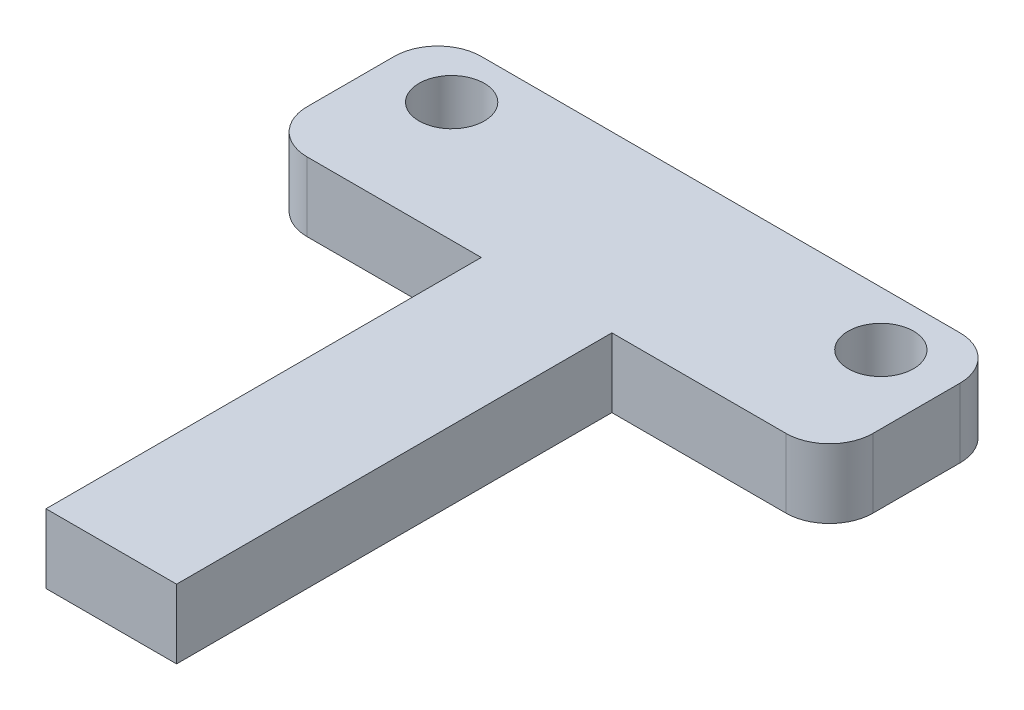
ISO-10303-21;
HEADER;
FILE_DESCRIPTION(('STEP AP214'),'2;1');
FILE_NAME('part.step','',(''),(''),'','','');
FILE_SCHEMA(('AUTOMOTIVE_DESIGN { 1 0 10303 214 1 1 1 1 }'));
ENDSEC;
DATA;
#1=APPLICATION_CONTEXT('core data for automotive mechanical design processes');
#2=APPLICATION_PROTOCOL_DEFINITION('international standard','automotive_design',2000,#1);
#3=PRODUCT_CONTEXT('',#1,'mechanical');
#4=PRODUCT('Part','Part','',(#3));
#5=PRODUCT_RELATED_PRODUCT_CATEGORY('part','',(#4));
#6=PRODUCT_DEFINITION_FORMATION('','',#4);
#7=PRODUCT_DEFINITION_CONTEXT('part definition',#1,'design');
#8=PRODUCT_DEFINITION('design','',#6,#7);
#9=PRODUCT_DEFINITION_SHAPE('','',#8);
#10=(LENGTH_UNIT() NAMED_UNIT(*) SI_UNIT(.MILLI.,.METRE.));
#11=(NAMED_UNIT(*) PLANE_ANGLE_UNIT() SI_UNIT($,.RADIAN.));
#12=(NAMED_UNIT(*) SI_UNIT($,.STERADIAN.) SOLID_ANGLE_UNIT());
#13=UNCERTAINTY_MEASURE_WITH_UNIT(LENGTH_MEASURE(1.E-05),#10,'distance_accuracy_value','');
#14=(GEOMETRIC_REPRESENTATION_CONTEXT(3) GLOBAL_UNCERTAINTY_ASSIGNED_CONTEXT((#13)) GLOBAL_UNIT_ASSIGNED_CONTEXT((#10,
#11,#12)) REPRESENTATION_CONTEXT('',''));
#15=CARTESIAN_POINT('',(0.,0.,0.));
#16=DIRECTION('',(0.,0.,1.));
#17=DIRECTION('',(1.,0.,0.));
#18=AXIS2_PLACEMENT_3D('',#15,#16,#17);
#19=CARTESIAN_POINT('',(11.,3.175,2.));
#20=DIRECTION('',(0.,1.,0.));
#21=DIRECTION('',(0.,0.,1.));
#22=AXIS2_PLACEMENT_3D('',#19,#20,#21);
#23=PLANE('',#22);
#24=CARTESIAN_POINT('',(-9.85999999999999,3.175,-1.5));
#25=DIRECTION('',(0.,1.,0.));
#26=DIRECTION('',(0.,0.,1.));
#27=AXIS2_PLACEMENT_3D('',#24,#25,#26);
#28=CIRCLE('',#27,1.5);
#29=CARTESIAN_POINT('',(-9.85999999999999,3.175,0.));
#30=VERTEX_POINT('',#29);
#31=EDGE_CURVE('E180',#30,#30,#28,.T.);
#32=ORIENTED_EDGE('',*,*,#31,.F.);
#33=EDGE_LOOP('',(#32));
#34=FACE_BOUND('',#33,.T.);
#35=DIRECTION('',(0.,0.,1.));
#36=VECTOR('',#35,1.);
#37=CARTESIAN_POINT('',(-2.99999999999999,3.175,4.));
#38=LINE('',#37,#36);
#39=CARTESIAN_POINT('',(-2.99999999999999,3.175,4.));
#40=VERTEX_POINT('',#39);
#41=CARTESIAN_POINT('',(-2.99999999999999,3.175,24.));
#42=VERTEX_POINT('',#41);
#43=EDGE_CURVE('E210',#40,#42,#38,.T.);
#44=ORIENTED_EDGE('',*,*,#43,.T.);
#45=DIRECTION('',(1.,0.,0.));
#46=VECTOR('',#45,1.);
#47=CARTESIAN_POINT('',(-2.99999999999999,3.175,24.));
#48=LINE('',#47,#46);
#49=CARTESIAN_POINT('',(3.,3.175,24.));
#50=VERTEX_POINT('',#49);
#51=EDGE_CURVE('E120',#42,#50,#48,.T.);
#52=ORIENTED_EDGE('',*,*,#51,.T.);
#53=DIRECTION('',(0.,0.,-1.));
#54=VECTOR('',#53,1.);
#55=CARTESIAN_POINT('',(3.00000000000001,3.175,4.));
#56=LINE('',#55,#54);
#57=CARTESIAN_POINT('',(3.00000000000001,3.175,4.));
#58=VERTEX_POINT('',#57);
#59=EDGE_CURVE('E249',#50,#58,#56,.T.);
#60=ORIENTED_EDGE('',*,*,#59,.T.);
#61=DIRECTION('',(1.,0.,0.));
#62=VECTOR('',#61,1.);
#63=CARTESIAN_POINT('',(3.00000000000001,3.175,4.));
#64=LINE('',#63,#62);
#65=CARTESIAN_POINT('',(11.,3.175,4.));
#66=VERTEX_POINT('',#65);
#67=EDGE_CURVE('E269',#58,#66,#64,.T.);
#68=ORIENTED_EDGE('',*,*,#67,.T.);
#69=CARTESIAN_POINT('',(11.,3.175,2.));
#70=DIRECTION('',(0.,1.,0.));
#71=DIRECTION('',(0.,0.,1.));
#72=AXIS2_PLACEMENT_3D('',#69,#70,#71);
#73=CIRCLE('',#72,2.);
#74=CARTESIAN_POINT('',(13.,3.175,2.));
#75=VERTEX_POINT('',#74);
#76=EDGE_CURVE('E265',#66,#75,#73,.T.);
#77=ORIENTED_EDGE('',*,*,#76,.T.);
#78=DIRECTION('',(0.,0.,-1.));
#79=VECTOR('',#78,1.);
#80=CARTESIAN_POINT('',(13.,3.175,-2.));
#81=LINE('',#80,#79);
#82=CARTESIAN_POINT('',(13.,3.175,-2.));
#83=VERTEX_POINT('',#82);
#84=EDGE_CURVE('E268',#75,#83,#81,.T.);
#85=ORIENTED_EDGE('',*,*,#84,.T.);
#86=CARTESIAN_POINT('',(11.,3.175,-2.));
#87=DIRECTION('',(0.,1.,0.));
#88=DIRECTION('',(0.,0.,-1.));
#89=AXIS2_PLACEMENT_3D('',#86,#87,#88);
#90=CIRCLE('',#89,2.);
#91=CARTESIAN_POINT('',(11.,3.175,-4.));
#92=VERTEX_POINT('',#91);
#93=EDGE_CURVE('E275',#83,#92,#90,.T.);
#94=ORIENTED_EDGE('',*,*,#93,.T.);
#95=DIRECTION('',(-1.,0.,0.));
#96=VECTOR('',#95,1.);
#97=CARTESIAN_POINT('',(-11.,3.175,-4.));
#98=LINE('',#97,#96);
#99=CARTESIAN_POINT('',(-11.,3.175,-4.));
#100=VERTEX_POINT('',#99);
#101=EDGE_CURVE('E282',#92,#100,#98,.T.);
#102=ORIENTED_EDGE('',*,*,#101,.T.);
#103=CARTESIAN_POINT('',(-11.,3.175,-2.));
#104=DIRECTION('',(0.,1.,0.));
#105=DIRECTION('',(0.,0.,1.));
#106=AXIS2_PLACEMENT_3D('',#103,#104,#105);
#107=CIRCLE('',#106,2.);
#108=CARTESIAN_POINT('',(-13.,3.175,-2.));
#109=VERTEX_POINT('',#108);
#110=EDGE_CURVE('E151',#100,#109,#107,.T.);
#111=ORIENTED_EDGE('',*,*,#110,.T.);
#112=DIRECTION('',(0.,0.,1.));
#113=VECTOR('',#112,1.);
#114=CARTESIAN_POINT('',(-13.,3.175,-2.));
#115=LINE('',#114,#113);
#116=CARTESIAN_POINT('',(-13.,3.175,2.));
#117=VERTEX_POINT('',#116);
#118=EDGE_CURVE('E145',#109,#117,#115,.T.);
#119=ORIENTED_EDGE('',*,*,#118,.T.);
#120=CARTESIAN_POINT('',(-11.,3.175,2.));
#121=DIRECTION('',(0.,1.,0.));
#122=DIRECTION('',(0.,0.,1.));
#123=AXIS2_PLACEMENT_3D('',#120,#121,#122);
#124=CIRCLE('',#123,2.);
#125=CARTESIAN_POINT('',(-11.,3.175,4.));
#126=VERTEX_POINT('',#125);
#127=EDGE_CURVE('E149',#117,#126,#124,.T.);
#128=ORIENTED_EDGE('',*,*,#127,.T.);
#129=DIRECTION('',(1.,0.,0.));
#130=VECTOR('',#129,1.);
#131=CARTESIAN_POINT('',(-11.,3.175,4.));
#132=LINE('',#131,#130);
#133=EDGE_CURVE('E65',#126,#40,#132,.T.);
#134=ORIENTED_EDGE('',*,*,#133,.T.);
#135=EDGE_LOOP('',(#44,#52,#60,#68,#77,#85,#94,#102,#111,#119,#128,#134));
#136=FACE_BOUND('',#135,.T.);
#137=CARTESIAN_POINT('',(9.86000000000001,3.175,-1.5));
#138=DIRECTION('',(0.,1.,0.));
#139=DIRECTION('',(0.,0.,-1.));
#140=AXIS2_PLACEMENT_3D('',#137,#138,#139);
#141=CIRCLE('',#140,1.5);
#142=CARTESIAN_POINT('',(9.86000000000001,3.175,-3.));
#143=VERTEX_POINT('',#142);
#144=EDGE_CURVE('E342',#143,#143,#141,.T.);
#145=ORIENTED_EDGE('',*,*,#144,.F.);
#146=EDGE_LOOP('',(#145));
#147=FACE_BOUND('',#146,.T.);
#148=ADVANCED_FACE('F47',(#34,#136,#147),#23,.T.);
#149=CARTESIAN_POINT('',(11.,0.,2.));
#150=DIRECTION('',(0.,1.,0.));
#151=DIRECTION('',(0.,0.,1.));
#152=AXIS2_PLACEMENT_3D('',#149,#150,#151);
#153=PLANE('',#152);
#154=DIRECTION('',(0.,0.,1.));
#155=VECTOR('',#154,1.);
#156=CARTESIAN_POINT('',(-2.99999999999999,0.,4.));
#157=LINE('',#156,#155);
#158=CARTESIAN_POINT('',(-2.99999999999999,0.,4.));
#159=VERTEX_POINT('',#158);
#160=CARTESIAN_POINT('',(-2.99999999999999,0.,24.));
#161=VERTEX_POINT('',#160);
#162=EDGE_CURVE('E175',#159,#161,#157,.T.);
#163=ORIENTED_EDGE('',*,*,#162,.F.);
#164=DIRECTION('',(1.,0.,0.));
#165=VECTOR('',#164,1.);
#166=CARTESIAN_POINT('',(-11.,0.,4.));
#167=LINE('',#166,#165);
#168=CARTESIAN_POINT('',(-11.,0.,4.));
#169=VERTEX_POINT('',#168);
#170=EDGE_CURVE('E112',#169,#159,#167,.T.);
#171=ORIENTED_EDGE('',*,*,#170,.F.);
#172=CARTESIAN_POINT('',(-11.,0.,2.));
#173=DIRECTION('',(0.,1.,0.));
#174=DIRECTION('',(0.,0.,1.));
#175=AXIS2_PLACEMENT_3D('',#172,#173,#174);
#176=CIRCLE('',#175,2.);
#177=CARTESIAN_POINT('',(-13.,0.,2.));
#178=VERTEX_POINT('',#177);
#179=EDGE_CURVE('E106',#178,#169,#176,.T.);
#180=ORIENTED_EDGE('',*,*,#179,.F.);
#181=DIRECTION('',(0.,0.,1.));
#182=VECTOR('',#181,1.);
#183=CARTESIAN_POINT('',(-13.,0.,-2.));
#184=LINE('',#183,#182);
#185=CARTESIAN_POINT('',(-13.,0.,-2.));
#186=VERTEX_POINT('',#185);
#187=EDGE_CURVE('E160',#186,#178,#184,.T.);
#188=ORIENTED_EDGE('',*,*,#187,.F.);
#189=CARTESIAN_POINT('',(-11.,0.,-2.));
#190=DIRECTION('',(0.,1.,0.));
#191=DIRECTION('',(0.,0.,1.));
#192=AXIS2_PLACEMENT_3D('',#189,#190,#191);
#193=CIRCLE('',#192,2.);
#194=CARTESIAN_POINT('',(-11.,0.,-4.));
#195=VERTEX_POINT('',#194);
#196=EDGE_CURVE('E201',#195,#186,#193,.T.);
#197=ORIENTED_EDGE('',*,*,#196,.F.);
#198=DIRECTION('',(-1.,0.,0.));
#199=VECTOR('',#198,1.);
#200=CARTESIAN_POINT('',(-11.,0.,-4.));
#201=LINE('',#200,#199);
#202=CARTESIAN_POINT('',(11.,0.,-4.));
#203=VERTEX_POINT('',#202);
#204=EDGE_CURVE('E198',#203,#195,#201,.T.);
#205=ORIENTED_EDGE('',*,*,#204,.F.);
#206=CARTESIAN_POINT('',(11.,0.,-2.));
#207=DIRECTION('',(0.,1.,0.));
#208=DIRECTION('',(0.,0.,-1.));
#209=AXIS2_PLACEMENT_3D('',#206,#207,#208);
#210=CIRCLE('',#209,2.);
#211=CARTESIAN_POINT('',(13.,0.,-2.));
#212=VERTEX_POINT('',#211);
#213=EDGE_CURVE('E195',#212,#203,#210,.T.);
#214=ORIENTED_EDGE('',*,*,#213,.F.);
#215=DIRECTION('',(0.,0.,-1.));
#216=VECTOR('',#215,1.);
#217=CARTESIAN_POINT('',(13.,0.,-2.));
#218=LINE('',#217,#216);
#219=CARTESIAN_POINT('',(13.,0.,2.));
#220=VERTEX_POINT('',#219);
#221=EDGE_CURVE('E192',#220,#212,#218,.T.);
#222=ORIENTED_EDGE('',*,*,#221,.F.);
#223=CARTESIAN_POINT('',(11.,0.,2.));
#224=DIRECTION('',(0.,1.,0.));
#225=DIRECTION('',(0.,0.,1.));
#226=AXIS2_PLACEMENT_3D('',#223,#224,#225);
#227=CIRCLE('',#226,2.);
#228=CARTESIAN_POINT('',(11.,0.,4.));
#229=VERTEX_POINT('',#228);
#230=EDGE_CURVE('E189',#229,#220,#227,.T.);
#231=ORIENTED_EDGE('',*,*,#230,.F.);
#232=DIRECTION('',(1.,0.,0.));
#233=VECTOR('',#232,1.);
#234=CARTESIAN_POINT('',(3.00000000000001,0.,4.));
#235=LINE('',#234,#233);
#236=CARTESIAN_POINT('',(3.00000000000001,0.,4.));
#237=VERTEX_POINT('',#236);
#238=EDGE_CURVE('E186',#237,#229,#235,.T.);
#239=ORIENTED_EDGE('',*,*,#238,.F.);
#240=DIRECTION('',(0.,0.,-1.));
#241=VECTOR('',#240,1.);
#242=CARTESIAN_POINT('',(3.00000000000001,0.,4.));
#243=LINE('',#242,#241);
#244=CARTESIAN_POINT('',(3.,0.,24.));
#245=VERTEX_POINT('',#244);
#246=EDGE_CURVE('E183',#245,#237,#243,.T.);
#247=ORIENTED_EDGE('',*,*,#246,.F.);
#248=DIRECTION('',(1.,0.,0.));
#249=VECTOR('',#248,1.);
#250=CARTESIAN_POINT('',(-2.99999999999999,0.,24.));
#251=LINE('',#250,#249);
#252=EDGE_CURVE('E179',#161,#245,#251,.T.);
#253=ORIENTED_EDGE('',*,*,#252,.F.);
#254=EDGE_LOOP('',(#163,#171,#180,#188,#197,#205,#214,#222,#231,#239,#247,#253));
#255=FACE_BOUND('',#254,.T.);
#256=CARTESIAN_POINT('',(-9.85999999999999,0.,-1.5));
#257=DIRECTION('',(0.,1.,0.));
#258=DIRECTION('',(0.,0.,1.));
#259=AXIS2_PLACEMENT_3D('',#256,#257,#258);
#260=CIRCLE('',#259,1.5);
#261=CARTESIAN_POINT('',(-9.85999999999999,0.,0.));
#262=VERTEX_POINT('',#261);
#263=EDGE_CURVE('E336',#262,#262,#260,.T.);
#264=ORIENTED_EDGE('',*,*,#263,.T.);
#265=EDGE_LOOP('',(#264));
#266=FACE_BOUND('',#265,.T.);
#267=CARTESIAN_POINT('',(9.86000000000001,0.,-1.5));
#268=DIRECTION('',(0.,1.,0.));
#269=DIRECTION('',(0.,0.,-1.));
#270=AXIS2_PLACEMENT_3D('',#267,#268,#269);
#271=CIRCLE('',#270,1.5);
#272=CARTESIAN_POINT('',(9.86000000000001,0.,-3.));
#273=VERTEX_POINT('',#272);
#274=EDGE_CURVE('E348',#273,#273,#271,.T.);
#275=ORIENTED_EDGE('',*,*,#274,.T.);
#276=EDGE_LOOP('',(#275));
#277=FACE_BOUND('',#276,.T.);
#278=ADVANCED_FACE('F253',(#255,#266,#277),#153,.F.);
#279=CARTESIAN_POINT('',(-2.99999999999999,3.175,4.));
#280=DIRECTION('',(1.,0.,0.));
#281=DIRECTION('',(0.,0.,-1.));
#282=AXIS2_PLACEMENT_3D('',#279,#280,#281);
#283=PLANE('',#282);
#284=ORIENTED_EDGE('',*,*,#162,.T.);
#285=DIRECTION('',(0.,-1.,0.));
#286=VECTOR('',#285,1.);
#287=CARTESIAN_POINT('',(-2.99999999999999,3.175,24.));
#288=LINE('',#287,#286);
#289=EDGE_CURVE('E11',#42,#161,#288,.T.);
#290=ORIENTED_EDGE('',*,*,#289,.F.);
#291=ORIENTED_EDGE('',*,*,#43,.F.);
#292=DIRECTION('',(0.,-1.,0.));
#293=VECTOR('',#292,1.);
#294=CARTESIAN_POINT('',(-2.99999999999999,3.175,4.));
#295=LINE('',#294,#293);
#296=EDGE_CURVE('E171',#40,#159,#295,.T.);
#297=ORIENTED_EDGE('',*,*,#296,.T.);
#298=EDGE_LOOP('',(#284,#290,#291,#297));
#299=FACE_BOUND('',#298,.T.);
#300=ADVANCED_FACE('F49',(#299),#283,.F.);
#301=CARTESIAN_POINT('',(-2.99999999999999,3.175,24.));
#302=DIRECTION('',(0.,0.,-1.));
#303=DIRECTION('',(-1.,0.,0.));
#304=AXIS2_PLACEMENT_3D('',#301,#302,#303);
#305=PLANE('',#304);
#306=ORIENTED_EDGE('',*,*,#252,.T.);
#307=DIRECTION('',(0.,-1.,0.));
#308=VECTOR('',#307,1.);
#309=CARTESIAN_POINT('',(3.,3.175,24.));
#310=LINE('',#309,#308);
#311=EDGE_CURVE('E57',#50,#245,#310,.T.);
#312=ORIENTED_EDGE('',*,*,#311,.F.);
#313=ORIENTED_EDGE('',*,*,#51,.F.);
#314=ORIENTED_EDGE('',*,*,#289,.T.);
#315=EDGE_LOOP('',(#306,#312,#313,#314));
#316=FACE_BOUND('',#315,.T.);
#317=ADVANCED_FACE('F405',(#316),#305,.F.);
#318=CARTESIAN_POINT('',(3.00000000000001,3.175,4.));
#319=DIRECTION('',(-1.,0.,0.));
#320=DIRECTION('',(0.,0.,1.));
#321=AXIS2_PLACEMENT_3D('',#318,#319,#320);
#322=PLANE('',#321);
#323=ORIENTED_EDGE('',*,*,#246,.T.);
#324=DIRECTION('',(0.,-1.,0.));
#325=VECTOR('',#324,1.);
#326=CARTESIAN_POINT('',(3.00000000000001,3.175,4.));
#327=LINE('',#326,#325);
#328=EDGE_CURVE('E237',#58,#237,#327,.T.);
#329=ORIENTED_EDGE('',*,*,#328,.F.);
#330=ORIENTED_EDGE('',*,*,#59,.F.);
#331=ORIENTED_EDGE('',*,*,#311,.T.);
#332=EDGE_LOOP('',(#323,#329,#330,#331));
#333=FACE_BOUND('',#332,.T.);
#334=ADVANCED_FACE('F247',(#333),#322,.F.);
#335=CARTESIAN_POINT('',(3.00000000000001,3.175,4.));
#336=DIRECTION('',(0.,0.,-1.));
#337=DIRECTION('',(-1.,0.,0.));
#338=AXIS2_PLACEMENT_3D('',#335,#336,#337);
#339=PLANE('',#338);
#340=ORIENTED_EDGE('',*,*,#238,.T.);
#341=DIRECTION('',(0.,-1.,0.));
#342=VECTOR('',#341,1.);
#343=CARTESIAN_POINT('',(11.,3.175,4.));
#344=LINE('',#343,#342);
#345=EDGE_CURVE('E233',#66,#229,#344,.T.);
#346=ORIENTED_EDGE('',*,*,#345,.F.);
#347=ORIENTED_EDGE('',*,*,#67,.F.);
#348=ORIENTED_EDGE('',*,*,#328,.T.);
#349=EDGE_LOOP('',(#340,#346,#347,#348));
#350=FACE_BOUND('',#349,.T.);
#351=ADVANCED_FACE('F259',(#350),#339,.F.);
#352=CARTESIAN_POINT('',(11.,3.175,2.));
#353=DIRECTION('',(0.,-1.,0.));
#354=DIRECTION('',(0.,0.,-1.));
#355=AXIS2_PLACEMENT_3D('',#352,#353,#354);
#356=CYLINDRICAL_SURFACE('',#355,2.);
#357=ORIENTED_EDGE('',*,*,#230,.T.);
#358=DIRECTION('',(0.,-1.,0.));
#359=VECTOR('',#358,1.);
#360=CARTESIAN_POINT('',(13.,3.175,2.));
#361=LINE('',#360,#359);
#362=EDGE_CURVE('E229',#75,#220,#361,.T.);
#363=ORIENTED_EDGE('',*,*,#362,.F.);
#364=ORIENTED_EDGE('',*,*,#76,.F.);
#365=ORIENTED_EDGE('',*,*,#345,.T.);
#366=EDGE_LOOP('',(#357,#363,#364,#365));
#367=FACE_BOUND('',#366,.T.);
#368=ADVANCED_FACE('F263',(#367),#356,.T.);
#369=CARTESIAN_POINT('',(13.,3.175,-2.));
#370=DIRECTION('',(-1.,0.,0.));
#371=DIRECTION('',(0.,0.,1.));
#372=AXIS2_PLACEMENT_3D('',#369,#370,#371);
#373=PLANE('',#372);
#374=ORIENTED_EDGE('',*,*,#221,.T.);
#375=DIRECTION('',(0.,-1.,0.));
#376=VECTOR('',#375,1.);
#377=CARTESIAN_POINT('',(13.,3.175,-2.));
#378=LINE('',#377,#376);
#379=EDGE_CURVE('E225',#83,#212,#378,.T.);
#380=ORIENTED_EDGE('',*,*,#379,.F.);
#381=ORIENTED_EDGE('',*,*,#84,.F.);
#382=ORIENTED_EDGE('',*,*,#362,.T.);
#383=EDGE_LOOP('',(#374,#380,#381,#382));
#384=FACE_BOUND('',#383,.T.);
#385=ADVANCED_FACE('F395',(#384),#373,.F.);
#386=CARTESIAN_POINT('',(11.,3.175,-2.));
#387=DIRECTION('',(0.,-1.,0.));
#388=DIRECTION('',(0.,0.,-1.));
#389=AXIS2_PLACEMENT_3D('',#386,#387,#388);
#390=CYLINDRICAL_SURFACE('',#389,2.);
#391=ORIENTED_EDGE('',*,*,#213,.T.);
#392=DIRECTION('',(0.,-1.,0.));
#393=VECTOR('',#392,1.);
#394=CARTESIAN_POINT('',(11.,3.175,-4.));
#395=LINE('',#394,#393);
#396=EDGE_CURVE('E221',#92,#203,#395,.T.);
#397=ORIENTED_EDGE('',*,*,#396,.F.);
#398=ORIENTED_EDGE('',*,*,#93,.F.);
#399=ORIENTED_EDGE('',*,*,#379,.T.);
#400=EDGE_LOOP('',(#391,#397,#398,#399));
#401=FACE_BOUND('',#400,.T.);
#402=ADVANCED_FACE('F391',(#401),#390,.T.);
#403=CARTESIAN_POINT('',(-11.,3.175,-4.));
#404=DIRECTION('',(0.,0.,1.));
#405=DIRECTION('',(1.,0.,0.));
#406=AXIS2_PLACEMENT_3D('',#403,#404,#405);
#407=PLANE('',#406);
#408=ORIENTED_EDGE('',*,*,#204,.T.);
#409=DIRECTION('',(0.,-1.,0.));
#410=VECTOR('',#409,1.);
#411=CARTESIAN_POINT('',(-11.,3.175,-4.));
#412=LINE('',#411,#410);
#413=EDGE_CURVE('E217',#100,#195,#412,.T.);
#414=ORIENTED_EDGE('',*,*,#413,.F.);
#415=ORIENTED_EDGE('',*,*,#101,.F.);
#416=ORIENTED_EDGE('',*,*,#396,.T.);
#417=EDGE_LOOP('',(#408,#414,#415,#416));
#418=FACE_BOUND('',#417,.T.);
#419=ADVANCED_FACE('F387',(#418),#407,.F.);
#420=CARTESIAN_POINT('',(-11.,3.175,-2.));
#421=DIRECTION('',(0.,-1.,0.));
#422=DIRECTION('',(0.,0.,-1.));
#423=AXIS2_PLACEMENT_3D('',#420,#421,#422);
#424=CYLINDRICAL_SURFACE('',#423,2.);
#425=ORIENTED_EDGE('',*,*,#196,.T.);
#426=DIRECTION('',(0.,-1.,0.));
#427=VECTOR('',#426,1.);
#428=CARTESIAN_POINT('',(-13.,3.175,-2.));
#429=LINE('',#428,#427);
#430=EDGE_CURVE('E162',#109,#186,#429,.T.);
#431=ORIENTED_EDGE('',*,*,#430,.F.);
#432=ORIENTED_EDGE('',*,*,#110,.F.);
#433=ORIENTED_EDGE('',*,*,#413,.T.);
#434=EDGE_LOOP('',(#425,#431,#432,#433));
#435=FACE_BOUND('',#434,.T.);
#436=ADVANCED_FACE('F384',(#435),#424,.T.);
#437=CARTESIAN_POINT('',(-13.,3.175,-2.));
#438=DIRECTION('',(1.,0.,0.));
#439=DIRECTION('',(0.,0.,-1.));
#440=AXIS2_PLACEMENT_3D('',#437,#438,#439);
#441=PLANE('',#440);
#442=ORIENTED_EDGE('',*,*,#187,.T.);
#443=DIRECTION('',(0.,-1.,0.));
#444=VECTOR('',#443,1.);
#445=CARTESIAN_POINT('',(-13.,3.175,2.));
#446=LINE('',#445,#444);
#447=EDGE_CURVE('E157',#117,#178,#446,.T.);
#448=ORIENTED_EDGE('',*,*,#447,.F.);
#449=ORIENTED_EDGE('',*,*,#118,.F.);
#450=ORIENTED_EDGE('',*,*,#430,.T.);
#451=EDGE_LOOP('',(#442,#448,#449,#450));
#452=FACE_BOUND('',#451,.T.);
#453=ADVANCED_FACE('F158',(#452),#441,.F.);
#454=CARTESIAN_POINT('',(-11.,3.175,2.));
#455=DIRECTION('',(0.,-1.,0.));
#456=DIRECTION('',(0.,0.,-1.));
#457=AXIS2_PLACEMENT_3D('',#454,#455,#456);
#458=CYLINDRICAL_SURFACE('',#457,2.);
#459=ORIENTED_EDGE('',*,*,#179,.T.);
#460=DIRECTION('',(0.,-1.,0.));
#461=VECTOR('',#460,1.);
#462=CARTESIAN_POINT('',(-11.,3.175,4.));
#463=LINE('',#462,#461);
#464=EDGE_CURVE('E163',#126,#169,#463,.T.);
#465=ORIENTED_EDGE('',*,*,#464,.F.);
#466=ORIENTED_EDGE('',*,*,#127,.F.);
#467=ORIENTED_EDGE('',*,*,#447,.T.);
#468=EDGE_LOOP('',(#459,#465,#466,#467));
#469=FACE_BOUND('',#468,.T.);
#470=ADVANCED_FACE('F165',(#469),#458,.T.);
#471=CARTESIAN_POINT('',(-11.,3.175,4.));
#472=DIRECTION('',(0.,0.,-1.));
#473=DIRECTION('',(-1.,0.,0.));
#474=AXIS2_PLACEMENT_3D('',#471,#472,#473);
#475=PLANE('',#474);
#476=ORIENTED_EDGE('',*,*,#170,.T.);
#477=ORIENTED_EDGE('',*,*,#296,.F.);
#478=ORIENTED_EDGE('',*,*,#133,.F.);
#479=ORIENTED_EDGE('',*,*,#464,.T.);
#480=EDGE_LOOP('',(#476,#477,#478,#479));
#481=FACE_BOUND('',#480,.T.);
#482=ADVANCED_FACE('F366',(#481),#475,.F.);
#483=CARTESIAN_POINT('',(-9.85999999999999,3.175,-1.5));
#484=DIRECTION('',(0.,-1.,0.));
#485=DIRECTION('',(0.,0.,-1.));
#486=AXIS2_PLACEMENT_3D('',#483,#484,#485);
#487=CYLINDRICAL_SURFACE('',#486,1.5);
#488=ORIENTED_EDGE('',*,*,#31,.T.);
#489=EDGE_LOOP('',(#488));
#490=FACE_BOUND('',#489,.T.);
#491=ORIENTED_EDGE('',*,*,#263,.F.);
#492=EDGE_LOOP('',(#491));
#493=FACE_BOUND('',#492,.T.);
#494=ADVANCED_FACE('F360',(#490,#493),#487,.F.);
#495=CARTESIAN_POINT('',(9.86000000000001,3.175,-1.5));
#496=DIRECTION('',(0.,-1.,0.));
#497=DIRECTION('',(0.,0.,-1.));
#498=AXIS2_PLACEMENT_3D('',#495,#496,#497);
#499=CYLINDRICAL_SURFACE('',#498,1.5);
#500=ORIENTED_EDGE('',*,*,#144,.T.);
#501=EDGE_LOOP('',(#500));
#502=FACE_BOUND('',#501,.T.);
#503=ORIENTED_EDGE('',*,*,#274,.F.);
#504=EDGE_LOOP('',(#503));
#505=FACE_BOUND('',#504,.T.);
#506=ADVANCED_FACE('F358',(#502,#505),#499,.F.);
#507=CLOSED_SHELL('',(#148,#278,#300,#317,#334,#351,#368,#385,#402,#419,#436,#453,#470,#482,
#494,#506));
#508=MANIFOLD_SOLID_BREP('B2',#507);
#509=ADVANCED_BREP_SHAPE_REPRESENTATION('',(#18,#508),#14);
#510=SHAPE_DEFINITION_REPRESENTATION(#9,#509);
ENDSEC;
END-ISO-10303-21;
